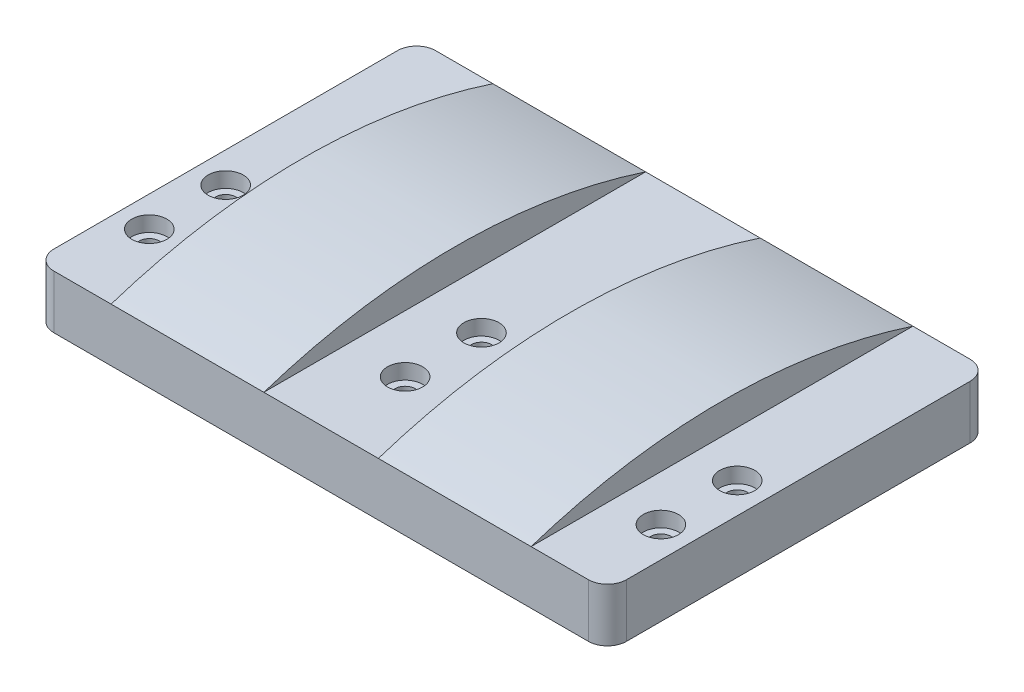
ISO-10303-21;
HEADER;
FILE_DESCRIPTION(('STEP AP214'),'2;1');
FILE_NAME('part.step','',(''),(''),'','','');
FILE_SCHEMA(('AUTOMOTIVE_DESIGN { 1 0 10303 214 1 1 1 1 }'));
ENDSEC;
DATA;
#1=APPLICATION_CONTEXT('core data for automotive mechanical design processes');
#2=APPLICATION_PROTOCOL_DEFINITION('international standard','automotive_design',2000,#1);
#3=PRODUCT_CONTEXT('',#1,'mechanical');
#4=PRODUCT('Part','Part','',(#3));
#5=PRODUCT_RELATED_PRODUCT_CATEGORY('part','',(#4));
#6=PRODUCT_DEFINITION_FORMATION('','',#4);
#7=PRODUCT_DEFINITION_CONTEXT('part definition',#1,'design');
#8=PRODUCT_DEFINITION('design','',#6,#7);
#9=PRODUCT_DEFINITION_SHAPE('','',#8);
#10=(LENGTH_UNIT() NAMED_UNIT(*) SI_UNIT(.MILLI.,.METRE.));
#11=(NAMED_UNIT(*) PLANE_ANGLE_UNIT() SI_UNIT($,.RADIAN.));
#12=(NAMED_UNIT(*) SI_UNIT($,.STERADIAN.) SOLID_ANGLE_UNIT());
#13=UNCERTAINTY_MEASURE_WITH_UNIT(LENGTH_MEASURE(1.E-05),#10,'distance_accuracy_value','');
#14=(GEOMETRIC_REPRESENTATION_CONTEXT(3) GLOBAL_UNCERTAINTY_ASSIGNED_CONTEXT((#13)) GLOBAL_UNIT_ASSIGNED_CONTEXT((#10,
#11,#12)) REPRESENTATION_CONTEXT('',''));
#15=CARTESIAN_POINT('',(0.,0.,0.));
#16=DIRECTION('',(0.,0.,1.));
#17=DIRECTION('',(1.,0.,0.));
#18=AXIS2_PLACEMENT_3D('',#15,#16,#17);
#19=CARTESIAN_POINT('',(0.,14.,0.));
#20=DIRECTION('',(0.,-1.,0.));
#21=DIRECTION('',(0.,0.,-1.));
#22=AXIS2_PLACEMENT_3D('',#19,#20,#21);
#23=PLANE('',#22);
#24=CARTESIAN_POINT('',(75.,14.,-42.));
#25=DIRECTION('',(0.,1.,0.));
#26=DIRECTION('',(0.,0.,1.));
#27=AXIS2_PLACEMENT_3D('',#24,#25,#26);
#28=CIRCLE('',#27,4.60000000000001);
#29=CARTESIAN_POINT('',(75.,14.,-37.4));
#30=VERTEX_POINT('',#29);
#31=EDGE_CURVE('E197',#30,#30,#28,.T.);
#32=ORIENTED_EDGE('',*,*,#31,.F.);
#33=EDGE_LOOP('',(#32));
#34=FACE_BOUND('',#33,.T.);
#35=CARTESIAN_POINT('',(75.,14.,-22.));
#36=DIRECTION('',(0.,1.,0.));
#37=DIRECTION('',(0.,0.,1.));
#38=AXIS2_PLACEMENT_3D('',#35,#36,#37);
#39=CIRCLE('',#38,4.6);
#40=CARTESIAN_POINT('',(75.,14.,-17.4));
#41=VERTEX_POINT('',#40);
#42=EDGE_CURVE('E216',#41,#41,#39,.T.);
#43=ORIENTED_EDGE('',*,*,#42,.F.);
#44=EDGE_LOOP('',(#43));
#45=FACE_BOUND('',#44,.T.);
#46=DIRECTION('',(0.,0.,-1.));
#47=VECTOR('',#46,1.);
#48=CARTESIAN_POINT('',(60.,14.,0.));
#49=LINE('',#48,#47);
#50=CARTESIAN_POINT('',(60.,14.,0.));
#51=VERTEX_POINT('',#50);
#52=CARTESIAN_POINT('',(60.,14.,-100.));
#53=VERTEX_POINT('',#52);
#54=EDGE_CURVE('E342',#51,#53,#49,.T.);
#55=ORIENTED_EDGE('',*,*,#54,.F.);
#56=DIRECTION('',(1.,0.,0.));
#57=VECTOR('',#56,1.);
#58=CARTESIAN_POINT('',(0.,14.,0.));
#59=LINE('',#58,#57);
#60=CARTESIAN_POINT('',(90.,14.,0.));
#61=VERTEX_POINT('',#60);
#62=EDGE_CURVE('E252',#51,#61,#59,.T.);
#63=ORIENTED_EDGE('',*,*,#62,.T.);
#64=DIRECTION('',(0.,0.,-1.));
#65=VECTOR('',#64,1.);
#66=CARTESIAN_POINT('',(90.,14.,0.));
#67=LINE('',#66,#65);
#68=CARTESIAN_POINT('',(90.,14.,-100.));
#69=VERTEX_POINT('',#68);
#70=EDGE_CURVE('E169',#61,#69,#67,.T.);
#71=ORIENTED_EDGE('',*,*,#70,.T.);
#72=DIRECTION('',(-1.,0.,0.));
#73=VECTOR('',#72,1.);
#74=CARTESIAN_POINT('',(0.,14.,-100.));
#75=LINE('',#74,#73);
#76=EDGE_CURVE('E144',#69,#53,#75,.T.);
#77=ORIENTED_EDGE('',*,*,#76,.T.);
#78=EDGE_LOOP('',(#55,#63,#71,#77));
#79=FACE_BOUND('',#78,.T.);
#80=ADVANCED_FACE('F42',(#34,#45,#79),#23,.F.);
#81=CARTESIAN_POINT('',(8.,14.,-42.));
#82=DIRECTION('',(0.,1.,0.));
#83=DIRECTION('',(0.,0.,1.));
#84=AXIS2_PLACEMENT_3D('',#81,#82,#83);
#85=CIRCLE('',#84,4.6);
#86=CARTESIAN_POINT('',(8.,14.,-37.4));
#87=VERTEX_POINT('',#86);
#88=EDGE_CURVE('E200',#87,#87,#85,.T.);
#89=ORIENTED_EDGE('',*,*,#88,.F.);
#90=EDGE_LOOP('',(#89));
#91=FACE_BOUND('',#90,.T.);
#92=CARTESIAN_POINT('',(8.,14.,-22.));
#93=DIRECTION('',(0.,1.,0.));
#94=DIRECTION('',(0.,0.,1.));
#95=AXIS2_PLACEMENT_3D('',#92,#93,#94);
#96=CIRCLE('',#95,4.6);
#97=CARTESIAN_POINT('',(8.,14.,-17.4));
#98=VERTEX_POINT('',#97);
#99=EDGE_CURVE('E210',#98,#98,#96,.T.);
#100=ORIENTED_EDGE('',*,*,#99,.F.);
#101=EDGE_LOOP('',(#100));
#102=FACE_BOUND('',#101,.T.);
#103=CARTESIAN_POINT('',(20.,14.,-100.));
#104=VERTEX_POINT('',#103);
#105=CARTESIAN_POINT('',(5.,14.,-100.));
#106=VERTEX_POINT('',#105);
#107=EDGE_CURVE('E132',#104,#106,#75,.T.);
#108=ORIENTED_EDGE('',*,*,#107,.T.);
#109=CARTESIAN_POINT('',(5.,14.,-95.));
#110=DIRECTION('',(0.,-1.,0.));
#111=DIRECTION('',(0.,0.,-1.));
#112=AXIS2_PLACEMENT_3D('',#109,#110,#111);
#113=CIRCLE('',#112,5.);
#114=CARTESIAN_POINT('',(0.,14.,-95.));
#115=VERTEX_POINT('',#114);
#116=EDGE_CURVE('E305',#106,#115,#113,.F.);
#117=ORIENTED_EDGE('',*,*,#116,.T.);
#118=DIRECTION('',(0.,0.,1.));
#119=VECTOR('',#118,1.);
#120=CARTESIAN_POINT('',(0.,14.,0.));
#121=LINE('',#120,#119);
#122=CARTESIAN_POINT('',(0.,14.,-5.));
#123=VERTEX_POINT('',#122);
#124=EDGE_CURVE('E247',#115,#123,#121,.T.);
#125=ORIENTED_EDGE('',*,*,#124,.T.);
#126=CARTESIAN_POINT('',(5.,14.,-5.));
#127=DIRECTION('',(0.,-1.,0.));
#128=DIRECTION('',(0.,0.,-1.));
#129=AXIS2_PLACEMENT_3D('',#126,#127,#128);
#130=CIRCLE('',#129,5.);
#131=CARTESIAN_POINT('',(5.,14.,0.));
#132=VERTEX_POINT('',#131);
#133=EDGE_CURVE('E57',#123,#132,#130,.F.);
#134=ORIENTED_EDGE('',*,*,#133,.T.);
#135=CARTESIAN_POINT('',(20.,14.,0.));
#136=VERTEX_POINT('',#135);
#137=EDGE_CURVE('E152',#132,#136,#59,.T.);
#138=ORIENTED_EDGE('',*,*,#137,.T.);
#139=DIRECTION('',(0.,0.,-1.));
#140=VECTOR('',#139,1.);
#141=CARTESIAN_POINT('',(20.,14.,0.));
#142=LINE('',#141,#140);
#143=EDGE_CURVE('E149',#136,#104,#142,.T.);
#144=ORIENTED_EDGE('',*,*,#143,.T.);
#145=EDGE_LOOP('',(#108,#117,#125,#134,#138,#144));
#146=FACE_BOUND('',#145,.T.);
#147=ADVANCED_FACE('F151',(#91,#102,#146),#23,.F.);
#148=CARTESIAN_POINT('',(8.,0.,-42.));
#149=DIRECTION('',(0.,1.,0.));
#150=DIRECTION('',(0.,0.,1.));
#151=AXIS2_PLACEMENT_3D('',#148,#149,#150);
#152=CYLINDRICAL_SURFACE('',#151,2.65);
#153=CARTESIAN_POINT('',(8.,0.,-42.));
#154=DIRECTION('',(0.,1.,0.));
#155=DIRECTION('',(0.,0.,1.));
#156=AXIS2_PLACEMENT_3D('',#153,#154,#155);
#157=CIRCLE('',#156,2.65);
#158=CARTESIAN_POINT('',(8.,0.,-39.35));
#159=VERTEX_POINT('',#158);
#160=EDGE_CURVE('E230',#159,#159,#157,.T.);
#161=ORIENTED_EDGE('',*,*,#160,.F.);
#162=EDGE_LOOP('',(#161));
#163=FACE_BOUND('',#162,.T.);
#164=CARTESIAN_POINT('',(8.,10.,-42.));
#165=DIRECTION('',(0.,1.,0.));
#166=DIRECTION('',(0.,0.,1.));
#167=AXIS2_PLACEMENT_3D('',#164,#165,#166);
#168=CIRCLE('',#167,2.65);
#169=CARTESIAN_POINT('',(8.,10.,-39.35));
#170=VERTEX_POINT('',#169);
#171=EDGE_CURVE('E243',#170,#170,#168,.F.);
#172=ORIENTED_EDGE('',*,*,#171,.F.);
#173=EDGE_LOOP('',(#172));
#174=FACE_BOUND('',#173,.T.);
#175=ADVANCED_FACE('F361',(#163,#174),#152,.F.);
#176=CARTESIAN_POINT('',(142.,0.,-42.));
#177=DIRECTION('',(0.,1.,0.));
#178=DIRECTION('',(0.,0.,1.));
#179=AXIS2_PLACEMENT_3D('',#176,#177,#178);
#180=CYLINDRICAL_SURFACE('',#179,2.65000000000002);
#181=CARTESIAN_POINT('',(142.,0.,-42.));
#182=DIRECTION('',(0.,1.,0.));
#183=DIRECTION('',(0.,0.,1.));
#184=AXIS2_PLACEMENT_3D('',#181,#182,#183);
#185=CIRCLE('',#184,2.65000000000002);
#186=CARTESIAN_POINT('',(142.,0.,-39.35));
#187=VERTEX_POINT('',#186);
#188=EDGE_CURVE('E227',#187,#187,#185,.T.);
#189=ORIENTED_EDGE('',*,*,#188,.F.);
#190=EDGE_LOOP('',(#189));
#191=FACE_BOUND('',#190,.T.);
#192=CARTESIAN_POINT('',(142.,10.,-42.));
#193=DIRECTION('',(0.,1.,0.));
#194=DIRECTION('',(0.,0.,1.));
#195=AXIS2_PLACEMENT_3D('',#192,#193,#194);
#196=CIRCLE('',#195,2.65000000000002);
#197=CARTESIAN_POINT('',(142.,10.,-39.35));
#198=VERTEX_POINT('',#197);
#199=EDGE_CURVE('E274',#198,#198,#196,.F.);
#200=ORIENTED_EDGE('',*,*,#199,.F.);
#201=EDGE_LOOP('',(#200));
#202=FACE_BOUND('',#201,.T.);
#203=ADVANCED_FACE('F433',(#191,#202),#180,.F.);
#204=CARTESIAN_POINT('',(75.,0.,-42.));
#205=DIRECTION('',(0.,1.,0.));
#206=DIRECTION('',(0.,0.,1.));
#207=AXIS2_PLACEMENT_3D('',#204,#205,#206);
#208=CYLINDRICAL_SURFACE('',#207,2.65);
#209=CARTESIAN_POINT('',(75.,0.,-42.));
#210=DIRECTION('',(0.,1.,0.));
#211=DIRECTION('',(0.,0.,1.));
#212=AXIS2_PLACEMENT_3D('',#209,#210,#211);
#213=CIRCLE('',#212,2.65);
#214=CARTESIAN_POINT('',(75.,0.,-39.35));
#215=VERTEX_POINT('',#214);
#216=EDGE_CURVE('E231',#215,#215,#213,.T.);
#217=ORIENTED_EDGE('',*,*,#216,.F.);
#218=EDGE_LOOP('',(#217));
#219=FACE_BOUND('',#218,.T.);
#220=CARTESIAN_POINT('',(75.,10.,-42.));
#221=DIRECTION('',(0.,1.,0.));
#222=DIRECTION('',(0.,0.,1.));
#223=AXIS2_PLACEMENT_3D('',#220,#221,#222);
#224=CIRCLE('',#223,2.65);
#225=CARTESIAN_POINT('',(75.,10.,-39.35));
#226=VERTEX_POINT('',#225);
#227=EDGE_CURVE('E271',#226,#226,#224,.F.);
#228=ORIENTED_EDGE('',*,*,#227,.F.);
#229=EDGE_LOOP('',(#228));
#230=FACE_BOUND('',#229,.T.);
#231=ADVANCED_FACE('F436',(#219,#230),#208,.F.);
#232=CARTESIAN_POINT('',(142.,0.,-22.));
#233=DIRECTION('',(0.,1.,0.));
#234=DIRECTION('',(0.,0.,1.));
#235=AXIS2_PLACEMENT_3D('',#232,#233,#234);
#236=CYLINDRICAL_SURFACE('',#235,2.65000000000001);
#237=CARTESIAN_POINT('',(142.,0.,-22.));
#238=DIRECTION('',(0.,1.,0.));
#239=DIRECTION('',(0.,0.,-1.));
#240=AXIS2_PLACEMENT_3D('',#237,#238,#239);
#241=CIRCLE('',#240,2.65000000000001);
#242=CARTESIAN_POINT('',(142.,0.,-24.65));
#243=VERTEX_POINT('',#242);
#244=EDGE_CURVE('E234',#243,#243,#241,.T.);
#245=ORIENTED_EDGE('',*,*,#244,.F.);
#246=EDGE_LOOP('',(#245));
#247=FACE_BOUND('',#246,.T.);
#248=CARTESIAN_POINT('',(142.,10.,-22.));
#249=DIRECTION('',(0.,1.,0.));
#250=DIRECTION('',(0.,0.,1.));
#251=AXIS2_PLACEMENT_3D('',#248,#249,#250);
#252=CIRCLE('',#251,2.65000000000001);
#253=CARTESIAN_POINT('',(142.,10.,-19.35));
#254=VERTEX_POINT('',#253);
#255=EDGE_CURVE('E268',#254,#254,#252,.F.);
#256=ORIENTED_EDGE('',*,*,#255,.F.);
#257=EDGE_LOOP('',(#256));
#258=FACE_BOUND('',#257,.T.);
#259=ADVANCED_FACE('F440',(#247,#258),#236,.F.);
#260=CARTESIAN_POINT('',(75.,0.,-22.));
#261=DIRECTION('',(0.,1.,0.));
#262=DIRECTION('',(0.,0.,1.));
#263=AXIS2_PLACEMENT_3D('',#260,#261,#262);
#264=CYLINDRICAL_SURFACE('',#263,2.65);
#265=CARTESIAN_POINT('',(75.,0.,-22.));
#266=DIRECTION('',(0.,1.,0.));
#267=DIRECTION('',(0.,0.,-1.));
#268=AXIS2_PLACEMENT_3D('',#265,#266,#267);
#269=CIRCLE('',#268,2.65);
#270=CARTESIAN_POINT('',(75.,0.,-24.65));
#271=VERTEX_POINT('',#270);
#272=EDGE_CURVE('E237',#271,#271,#269,.T.);
#273=ORIENTED_EDGE('',*,*,#272,.F.);
#274=EDGE_LOOP('',(#273));
#275=FACE_BOUND('',#274,.T.);
#276=CARTESIAN_POINT('',(75.,10.,-22.));
#277=DIRECTION('',(0.,1.,0.));
#278=DIRECTION('',(0.,0.,1.));
#279=AXIS2_PLACEMENT_3D('',#276,#277,#278);
#280=CIRCLE('',#279,2.65);
#281=CARTESIAN_POINT('',(75.,10.,-19.35));
#282=VERTEX_POINT('',#281);
#283=EDGE_CURVE('E265',#282,#282,#280,.F.);
#284=ORIENTED_EDGE('',*,*,#283,.F.);
#285=EDGE_LOOP('',(#284));
#286=FACE_BOUND('',#285,.T.);
#287=ADVANCED_FACE('F444',(#275,#286),#264,.F.);
#288=CARTESIAN_POINT('',(8.,0.,-22.));
#289=DIRECTION('',(0.,1.,0.));
#290=DIRECTION('',(0.,0.,1.));
#291=AXIS2_PLACEMENT_3D('',#288,#289,#290);
#292=CYLINDRICAL_SURFACE('',#291,2.65);
#293=CARTESIAN_POINT('',(8.,0.,-22.));
#294=DIRECTION('',(0.,1.,0.));
#295=DIRECTION('',(0.,0.,-1.));
#296=AXIS2_PLACEMENT_3D('',#293,#294,#295);
#297=CIRCLE('',#296,2.65);
#298=CARTESIAN_POINT('',(8.,0.,-24.65));
#299=VERTEX_POINT('',#298);
#300=EDGE_CURVE('E240',#299,#299,#297,.T.);
#301=ORIENTED_EDGE('',*,*,#300,.F.);
#302=EDGE_LOOP('',(#301));
#303=FACE_BOUND('',#302,.T.);
#304=CARTESIAN_POINT('',(8.,10.,-22.));
#305=DIRECTION('',(0.,1.,0.));
#306=DIRECTION('',(0.,0.,1.));
#307=AXIS2_PLACEMENT_3D('',#304,#305,#306);
#308=CIRCLE('',#307,2.65);
#309=CARTESIAN_POINT('',(8.,10.,-19.35));
#310=VERTEX_POINT('',#309);
#311=EDGE_CURVE('E224',#310,#310,#308,.F.);
#312=ORIENTED_EDGE('',*,*,#311,.F.);
#313=EDGE_LOOP('',(#312));
#314=FACE_BOUND('',#313,.T.);
#315=ADVANCED_FACE('F448',(#303,#314),#292,.F.);
#316=CARTESIAN_POINT('',(0.,14.,0.));
#317=DIRECTION('',(1.,0.,0.));
#318=DIRECTION('',(0.,0.,-1.));
#319=AXIS2_PLACEMENT_3D('',#316,#317,#318);
#320=PLANE('',#319);
#321=ORIENTED_EDGE('',*,*,#124,.F.);
#322=DIRECTION('',(0.,-1.,0.));
#323=VECTOR('',#322,1.);
#324=CARTESIAN_POINT('',(0.,14.,-95.));
#325=LINE('',#324,#323);
#326=CARTESIAN_POINT('',(0.,0.,-95.));
#327=VERTEX_POINT('',#326);
#328=EDGE_CURVE('E301',#115,#327,#325,.T.);
#329=ORIENTED_EDGE('',*,*,#328,.T.);
#330=DIRECTION('',(0.,0.,1.));
#331=VECTOR('',#330,1.);
#332=CARTESIAN_POINT('',(0.,0.,0.));
#333=LINE('',#332,#331);
#334=CARTESIAN_POINT('',(0.,0.,-5.));
#335=VERTEX_POINT('',#334);
#336=EDGE_CURVE('E246',#327,#335,#333,.T.);
#337=ORIENTED_EDGE('',*,*,#336,.T.);
#338=DIRECTION('',(0.,-1.,0.));
#339=VECTOR('',#338,1.);
#340=CARTESIAN_POINT('',(0.,14.,-5.));
#341=LINE('',#340,#339);
#342=EDGE_CURVE('E65',#335,#123,#341,.F.);
#343=ORIENTED_EDGE('',*,*,#342,.T.);
#344=EDGE_LOOP('',(#321,#329,#337,#343));
#345=FACE_BOUND('',#344,.T.);
#346=ADVANCED_FACE('F451',(#345),#320,.F.);
#347=CARTESIAN_POINT('',(0.,14.,0.));
#348=DIRECTION('',(0.,0.,-1.));
#349=DIRECTION('',(-1.,0.,0.));
#350=AXIS2_PLACEMENT_3D('',#347,#348,#349);
#351=PLANE('',#350);
#352=ORIENTED_EDGE('',*,*,#137,.F.);
#353=DIRECTION('',(0.,-1.,0.));
#354=VECTOR('',#353,1.);
#355=CARTESIAN_POINT('',(5.,14.,0.));
#356=LINE('',#355,#354);
#357=CARTESIAN_POINT('',(5.,0.,0.));
#358=VERTEX_POINT('',#357);
#359=EDGE_CURVE('E11',#132,#358,#356,.T.);
#360=ORIENTED_EDGE('',*,*,#359,.T.);
#361=DIRECTION('',(1.,0.,0.));
#362=VECTOR('',#361,1.);
#363=CARTESIAN_POINT('',(0.,0.,0.));
#364=LINE('',#363,#362);
#365=CARTESIAN_POINT('',(145.,0.,0.));
#366=VERTEX_POINT('',#365);
#367=EDGE_CURVE('E256',#358,#366,#364,.T.);
#368=ORIENTED_EDGE('',*,*,#367,.T.);
#369=DIRECTION('',(0.,-1.,0.));
#370=VECTOR('',#369,1.);
#371=CARTESIAN_POINT('',(145.,14.,0.));
#372=LINE('',#371,#370);
#373=CARTESIAN_POINT('',(145.,14.,0.));
#374=VERTEX_POINT('',#373);
#375=EDGE_CURVE('E50',#366,#374,#372,.F.);
#376=ORIENTED_EDGE('',*,*,#375,.T.);
#377=CARTESIAN_POINT('',(130.,14.,0.));
#378=VERTEX_POINT('',#377);
#379=EDGE_CURVE('E249',#378,#374,#59,.T.);
#380=ORIENTED_EDGE('',*,*,#379,.F.);
#381=DIRECTION('',(-1.,0.,0.));
#382=VECTOR('',#381,1.);
#383=CARTESIAN_POINT('',(130.,14.,0.));
#384=LINE('',#383,#382);
#385=EDGE_CURVE('E181',#378,#61,#384,.T.);
#386=ORIENTED_EDGE('',*,*,#385,.T.);
#387=ORIENTED_EDGE('',*,*,#62,.F.);
#388=DIRECTION('',(1.,0.,0.));
#389=VECTOR('',#388,1.);
#390=CARTESIAN_POINT('',(20.,14.,0.));
#391=LINE('',#390,#389);
#392=EDGE_CURVE('E167',#136,#51,#391,.T.);
#393=ORIENTED_EDGE('',*,*,#392,.F.);
#394=EDGE_LOOP('',(#352,#360,#368,#376,#380,#386,#387,#393));
#395=FACE_BOUND('',#394,.T.);
#396=ADVANCED_FACE('F310',(#395),#351,.F.);
#397=CARTESIAN_POINT('',(150.,14.,0.));
#398=DIRECTION('',(-1.,0.,0.));
#399=DIRECTION('',(0.,0.,1.));
#400=AXIS2_PLACEMENT_3D('',#397,#398,#399);
#401=PLANE('',#400);
#402=DIRECTION('',(0.,0.,-1.));
#403=VECTOR('',#402,1.);
#404=CARTESIAN_POINT('',(150.,0.,0.));
#405=LINE('',#404,#403);
#406=CARTESIAN_POINT('',(150.,0.,-5.));
#407=VERTEX_POINT('',#406);
#408=CARTESIAN_POINT('',(150.,0.,-95.));
#409=VERTEX_POINT('',#408);
#410=EDGE_CURVE('E259',#407,#409,#405,.T.);
#411=ORIENTED_EDGE('',*,*,#410,.T.);
#412=DIRECTION('',(0.,-1.,0.));
#413=VECTOR('',#412,1.);
#414=CARTESIAN_POINT('',(150.,14.,-95.));
#415=LINE('',#414,#413);
#416=CARTESIAN_POINT('',(150.,14.,-95.));
#417=VERTEX_POINT('',#416);
#418=EDGE_CURVE('E294',#409,#417,#415,.F.);
#419=ORIENTED_EDGE('',*,*,#418,.T.);
#420=DIRECTION('',(0.,0.,-1.));
#421=VECTOR('',#420,1.);
#422=CARTESIAN_POINT('',(150.,14.,0.));
#423=LINE('',#422,#421);
#424=CARTESIAN_POINT('',(150.,14.,-5.));
#425=VERTEX_POINT('',#424);
#426=EDGE_CURVE('E145',#425,#417,#423,.T.);
#427=ORIENTED_EDGE('',*,*,#426,.F.);
#428=DIRECTION('',(0.,-1.,0.));
#429=VECTOR('',#428,1.);
#430=CARTESIAN_POINT('',(150.,14.,-5.));
#431=LINE('',#430,#429);
#432=EDGE_CURVE('E291',#425,#407,#431,.T.);
#433=ORIENTED_EDGE('',*,*,#432,.T.);
#434=EDGE_LOOP('',(#411,#419,#427,#433));
#435=FACE_BOUND('',#434,.T.);
#436=ADVANCED_FACE('F321',(#435),#401,.F.);
#437=CARTESIAN_POINT('',(0.,14.,-100.));
#438=DIRECTION('',(0.,0.,1.));
#439=DIRECTION('',(1.,0.,0.));
#440=AXIS2_PLACEMENT_3D('',#437,#438,#439);
#441=PLANE('',#440);
#442=CARTESIAN_POINT('',(145.,14.,-100.));
#443=VERTEX_POINT('',#442);
#444=CARTESIAN_POINT('',(130.,14.,-100.));
#445=VERTEX_POINT('',#444);
#446=EDGE_CURVE('E147',#443,#445,#75,.T.);
#447=ORIENTED_EDGE('',*,*,#446,.F.);
#448=DIRECTION('',(0.,-1.,0.));
#449=VECTOR('',#448,1.);
#450=CARTESIAN_POINT('',(145.,14.,-100.));
#451=LINE('',#450,#449);
#452=CARTESIAN_POINT('',(145.,0.,-100.));
#453=VERTEX_POINT('',#452);
#454=EDGE_CURVE('E280',#443,#453,#451,.T.);
#455=ORIENTED_EDGE('',*,*,#454,.T.);
#456=DIRECTION('',(-1.,0.,0.));
#457=VECTOR('',#456,1.);
#458=CARTESIAN_POINT('',(0.,0.,-100.));
#459=LINE('',#458,#457);
#460=CARTESIAN_POINT('',(5.,0.,-100.));
#461=VERTEX_POINT('',#460);
#462=EDGE_CURVE('E250',#453,#461,#459,.T.);
#463=ORIENTED_EDGE('',*,*,#462,.T.);
#464=DIRECTION('',(0.,-1.,0.));
#465=VECTOR('',#464,1.);
#466=CARTESIAN_POINT('',(5.,14.,-100.));
#467=LINE('',#466,#465);
#468=EDGE_CURVE('E142',#461,#106,#467,.F.);
#469=ORIENTED_EDGE('',*,*,#468,.T.);
#470=ORIENTED_EDGE('',*,*,#107,.F.);
#471=DIRECTION('',(1.,0.,0.));
#472=VECTOR('',#471,1.);
#473=CARTESIAN_POINT('',(20.,14.,-100.));
#474=LINE('',#473,#472);
#475=EDGE_CURVE('E138',#104,#53,#474,.T.);
#476=ORIENTED_EDGE('',*,*,#475,.T.);
#477=ORIENTED_EDGE('',*,*,#76,.F.);
#478=DIRECTION('',(-1.,0.,0.));
#479=VECTOR('',#478,1.);
#480=CARTESIAN_POINT('',(130.,14.,-100.));
#481=LINE('',#480,#479);
#482=EDGE_CURVE('E187',#445,#69,#481,.T.);
#483=ORIENTED_EDGE('',*,*,#482,.F.);
#484=EDGE_LOOP('',(#447,#455,#463,#469,#470,#476,#477,#483));
#485=FACE_BOUND('',#484,.T.);
#486=ADVANCED_FACE('F135',(#485),#441,.F.);
#487=CARTESIAN_POINT('',(142.,14.,-42.));
#488=DIRECTION('',(0.,1.,0.));
#489=DIRECTION('',(0.,0.,1.));
#490=AXIS2_PLACEMENT_3D('',#487,#488,#489);
#491=CIRCLE('',#490,4.59999999999999);
#492=CARTESIAN_POINT('',(142.,14.,-37.4000000000001));
#493=VERTEX_POINT('',#492);
#494=EDGE_CURVE('E204',#493,#493,#491,.T.);
#495=ORIENTED_EDGE('',*,*,#494,.F.);
#496=EDGE_LOOP('',(#495));
#497=FACE_BOUND('',#496,.T.);
#498=CARTESIAN_POINT('',(142.,14.,-22.));
#499=DIRECTION('',(0.,1.,0.));
#500=DIRECTION('',(0.,0.,1.));
#501=AXIS2_PLACEMENT_3D('',#498,#499,#500);
#502=CIRCLE('',#501,4.59999999999999);
#503=CARTESIAN_POINT('',(142.,14.,-17.4));
#504=VERTEX_POINT('',#503);
#505=EDGE_CURVE('E191',#504,#504,#502,.T.);
#506=ORIENTED_EDGE('',*,*,#505,.F.);
#507=EDGE_LOOP('',(#506));
#508=FACE_BOUND('',#507,.T.);
#509=ORIENTED_EDGE('',*,*,#426,.T.);
#510=CARTESIAN_POINT('',(145.,14.,-95.));
#511=DIRECTION('',(0.,-1.,0.));
#512=DIRECTION('',(0.,0.,-1.));
#513=AXIS2_PLACEMENT_3D('',#510,#511,#512);
#514=CIRCLE('',#513,5.);
#515=EDGE_CURVE('E298',#417,#443,#514,.F.);
#516=ORIENTED_EDGE('',*,*,#515,.T.);
#517=ORIENTED_EDGE('',*,*,#446,.T.);
#518=DIRECTION('',(0.,0.,-1.));
#519=VECTOR('',#518,1.);
#520=CARTESIAN_POINT('',(130.,14.,0.));
#521=LINE('',#520,#519);
#522=EDGE_CURVE('E174',#378,#445,#521,.T.);
#523=ORIENTED_EDGE('',*,*,#522,.F.);
#524=ORIENTED_EDGE('',*,*,#379,.T.);
#525=CARTESIAN_POINT('',(145.,14.,-5.));
#526=DIRECTION('',(0.,-1.,0.));
#527=DIRECTION('',(0.,0.,-1.));
#528=AXIS2_PLACEMENT_3D('',#525,#526,#527);
#529=CIRCLE('',#528,5.);
#530=EDGE_CURVE('E296',#374,#425,#529,.F.);
#531=ORIENTED_EDGE('',*,*,#530,.T.);
#532=EDGE_LOOP('',(#509,#516,#517,#523,#524,#531));
#533=FACE_BOUND('',#532,.T.);
#534=ADVANCED_FACE('F316',(#497,#508,#533),#23,.F.);
#535=CARTESIAN_POINT('',(0.,0.,0.));
#536=DIRECTION('',(0.,-1.,0.));
#537=DIRECTION('',(0.,0.,-1.));
#538=AXIS2_PLACEMENT_3D('',#535,#536,#537);
#539=PLANE('',#538);
#540=ORIENTED_EDGE('',*,*,#300,.T.);
#541=EDGE_LOOP('',(#540));
#542=FACE_BOUND('',#541,.T.);
#543=ORIENTED_EDGE('',*,*,#272,.T.);
#544=EDGE_LOOP('',(#543));
#545=FACE_BOUND('',#544,.T.);
#546=ORIENTED_EDGE('',*,*,#244,.T.);
#547=EDGE_LOOP('',(#546));
#548=FACE_BOUND('',#547,.T.);
#549=ORIENTED_EDGE('',*,*,#216,.T.);
#550=EDGE_LOOP('',(#549));
#551=FACE_BOUND('',#550,.T.);
#552=ORIENTED_EDGE('',*,*,#188,.T.);
#553=EDGE_LOOP('',(#552));
#554=FACE_BOUND('',#553,.T.);
#555=ORIENTED_EDGE('',*,*,#160,.T.);
#556=EDGE_LOOP('',(#555));
#557=FACE_BOUND('',#556,.T.);
#558=ORIENTED_EDGE('',*,*,#462,.F.);
#559=CARTESIAN_POINT('',(145.,0.,-95.));
#560=DIRECTION('',(0.,-1.,0.));
#561=DIRECTION('',(0.,0.,-1.));
#562=AXIS2_PLACEMENT_3D('',#559,#560,#561);
#563=CIRCLE('',#562,5.);
#564=EDGE_CURVE('E289',#453,#409,#563,.T.);
#565=ORIENTED_EDGE('',*,*,#564,.T.);
#566=ORIENTED_EDGE('',*,*,#410,.F.);
#567=CARTESIAN_POINT('',(145.,0.,-5.));
#568=DIRECTION('',(0.,-1.,0.));
#569=DIRECTION('',(0.,0.,-1.));
#570=AXIS2_PLACEMENT_3D('',#567,#568,#569);
#571=CIRCLE('',#570,5.);
#572=EDGE_CURVE('E283',#407,#366,#571,.T.);
#573=ORIENTED_EDGE('',*,*,#572,.T.);
#574=ORIENTED_EDGE('',*,*,#367,.F.);
#575=CARTESIAN_POINT('',(5.,0.,-5.));
#576=DIRECTION('',(0.,-1.,0.));
#577=DIRECTION('',(0.,0.,-1.));
#578=AXIS2_PLACEMENT_3D('',#575,#576,#577);
#579=CIRCLE('',#578,5.);
#580=EDGE_CURVE('E285',#358,#335,#579,.T.);
#581=ORIENTED_EDGE('',*,*,#580,.T.);
#582=ORIENTED_EDGE('',*,*,#336,.F.);
#583=CARTESIAN_POINT('',(5.,0.,-95.));
#584=DIRECTION('',(0.,-1.,0.));
#585=DIRECTION('',(0.,0.,-1.));
#586=AXIS2_PLACEMENT_3D('',#583,#584,#585);
#587=CIRCLE('',#586,5.);
#588=EDGE_CURVE('E287',#327,#461,#587,.T.);
#589=ORIENTED_EDGE('',*,*,#588,.T.);
#590=EDGE_LOOP('',(#558,#565,#566,#573,#574,#581,#582,#589));
#591=FACE_BOUND('',#590,.T.);
#592=ADVANCED_FACE('F325',(#542,#545,#548,#551,#554,#557,#591),#539,.T.);
#593=CARTESIAN_POINT('',(8.,10.,-22.));
#594=DIRECTION('',(0.,1.,0.));
#595=DIRECTION('',(0.,0.,1.));
#596=AXIS2_PLACEMENT_3D('',#593,#594,#595);
#597=PLANE('',#596);
#598=CARTESIAN_POINT('',(8.,10.,-22.));
#599=DIRECTION('',(0.,1.,0.));
#600=DIRECTION('',(0.,0.,1.));
#601=AXIS2_PLACEMENT_3D('',#598,#599,#600);
#602=CIRCLE('',#601,4.6);
#603=CARTESIAN_POINT('',(8.,10.,-17.4));
#604=VERTEX_POINT('',#603);
#605=EDGE_CURVE('E213',#604,#604,#602,.T.);
#606=ORIENTED_EDGE('',*,*,#605,.T.);
#607=EDGE_LOOP('',(#606));
#608=FACE_BOUND('',#607,.T.);
#609=ORIENTED_EDGE('',*,*,#311,.T.);
#610=EDGE_LOOP('',(#609));
#611=FACE_BOUND('',#610,.T.);
#612=ADVANCED_FACE('F373',(#608,#611),#597,.T.);
#613=CARTESIAN_POINT('',(8.,10.,-22.));
#614=DIRECTION('',(0.,1.,0.));
#615=DIRECTION('',(0.,0.,1.));
#616=AXIS2_PLACEMENT_3D('',#613,#614,#615);
#617=CYLINDRICAL_SURFACE('',#616,4.6);
#618=ORIENTED_EDGE('',*,*,#605,.F.);
#619=EDGE_LOOP('',(#618));
#620=FACE_BOUND('',#619,.T.);
#621=ORIENTED_EDGE('',*,*,#99,.T.);
#622=EDGE_LOOP('',(#621));
#623=FACE_BOUND('',#622,.T.);
#624=ADVANCED_FACE('F412',(#620,#623),#617,.F.);
#625=CARTESIAN_POINT('',(75.,10.,-22.));
#626=DIRECTION('',(0.,1.,0.));
#627=DIRECTION('',(0.,0.,1.));
#628=AXIS2_PLACEMENT_3D('',#625,#626,#627);
#629=PLANE('',#628);
#630=CARTESIAN_POINT('',(75.,10.,-22.));
#631=DIRECTION('',(0.,1.,0.));
#632=DIRECTION('',(0.,0.,1.));
#633=AXIS2_PLACEMENT_3D('',#630,#631,#632);
#634=CIRCLE('',#633,4.6);
#635=CARTESIAN_POINT('',(75.,10.,-17.4));
#636=VERTEX_POINT('',#635);
#637=EDGE_CURVE('E194',#636,#636,#634,.T.);
#638=ORIENTED_EDGE('',*,*,#637,.T.);
#639=EDGE_LOOP('',(#638));
#640=FACE_BOUND('',#639,.T.);
#641=ORIENTED_EDGE('',*,*,#283,.T.);
#642=EDGE_LOOP('',(#641));
#643=FACE_BOUND('',#642,.T.);
#644=ADVANCED_FACE('F415',(#640,#643),#629,.T.);
#645=CARTESIAN_POINT('',(75.,10.,-22.));
#646=DIRECTION('',(0.,1.,0.));
#647=DIRECTION('',(0.,0.,1.));
#648=AXIS2_PLACEMENT_3D('',#645,#646,#647);
#649=CYLINDRICAL_SURFACE('',#648,4.6);
#650=ORIENTED_EDGE('',*,*,#637,.F.);
#651=EDGE_LOOP('',(#650));
#652=FACE_BOUND('',#651,.T.);
#653=ORIENTED_EDGE('',*,*,#42,.T.);
#654=EDGE_LOOP('',(#653));
#655=FACE_BOUND('',#654,.T.);
#656=ADVANCED_FACE('F393',(#652,#655),#649,.F.);
#657=CARTESIAN_POINT('',(142.,10.,-22.));
#658=DIRECTION('',(0.,1.,0.));
#659=DIRECTION('',(0.,0.,1.));
#660=AXIS2_PLACEMENT_3D('',#657,#658,#659);
#661=PLANE('',#660);
#662=CARTESIAN_POINT('',(142.,10.,-22.));
#663=DIRECTION('',(0.,1.,0.));
#664=DIRECTION('',(0.,0.,1.));
#665=AXIS2_PLACEMENT_3D('',#662,#663,#664);
#666=CIRCLE('',#665,4.59999999999999);
#667=CARTESIAN_POINT('',(142.,10.,-17.4));
#668=VERTEX_POINT('',#667);
#669=EDGE_CURVE('E190',#668,#668,#666,.T.);
#670=ORIENTED_EDGE('',*,*,#669,.T.);
#671=EDGE_LOOP('',(#670));
#672=FACE_BOUND('',#671,.T.);
#673=ORIENTED_EDGE('',*,*,#255,.T.);
#674=EDGE_LOOP('',(#673));
#675=FACE_BOUND('',#674,.T.);
#676=ADVANCED_FACE('F383',(#672,#675),#661,.T.);
#677=CARTESIAN_POINT('',(142.,10.,-22.));
#678=DIRECTION('',(0.,1.,0.));
#679=DIRECTION('',(0.,0.,1.));
#680=AXIS2_PLACEMENT_3D('',#677,#678,#679);
#681=CYLINDRICAL_SURFACE('',#680,4.59999999999999);
#682=ORIENTED_EDGE('',*,*,#669,.F.);
#683=EDGE_LOOP('',(#682));
#684=FACE_BOUND('',#683,.T.);
#685=ORIENTED_EDGE('',*,*,#505,.T.);
#686=EDGE_LOOP('',(#685));
#687=FACE_BOUND('',#686,.T.);
#688=ADVANCED_FACE('F380',(#684,#687),#681,.F.);
#689=CARTESIAN_POINT('',(75.,10.,-42.));
#690=DIRECTION('',(0.,1.,0.));
#691=DIRECTION('',(0.,0.,1.));
#692=AXIS2_PLACEMENT_3D('',#689,#690,#691);
#693=PLANE('',#692);
#694=CARTESIAN_POINT('',(75.,10.,-42.));
#695=DIRECTION('',(0.,1.,0.));
#696=DIRECTION('',(0.,0.,1.));
#697=AXIS2_PLACEMENT_3D('',#694,#695,#696);
#698=CIRCLE('',#697,4.60000000000001);
#699=CARTESIAN_POINT('',(75.,10.,-37.4));
#700=VERTEX_POINT('',#699);
#701=EDGE_CURVE('E201',#700,#700,#698,.T.);
#702=ORIENTED_EDGE('',*,*,#701,.T.);
#703=EDGE_LOOP('',(#702));
#704=FACE_BOUND('',#703,.T.);
#705=ORIENTED_EDGE('',*,*,#227,.T.);
#706=EDGE_LOOP('',(#705));
#707=FACE_BOUND('',#706,.T.);
#708=ADVANCED_FACE('F382',(#704,#707),#693,.T.);
#709=CARTESIAN_POINT('',(75.,10.,-42.));
#710=DIRECTION('',(0.,1.,0.));
#711=DIRECTION('',(0.,0.,1.));
#712=AXIS2_PLACEMENT_3D('',#709,#710,#711);
#713=CYLINDRICAL_SURFACE('',#712,4.60000000000001);
#714=ORIENTED_EDGE('',*,*,#701,.F.);
#715=EDGE_LOOP('',(#714));
#716=FACE_BOUND('',#715,.T.);
#717=ORIENTED_EDGE('',*,*,#31,.T.);
#718=EDGE_LOOP('',(#717));
#719=FACE_BOUND('',#718,.T.);
#720=ADVANCED_FACE('F390',(#716,#719),#713,.F.);
#721=CARTESIAN_POINT('',(142.,10.,-42.));
#722=DIRECTION('',(0.,1.,0.));
#723=DIRECTION('',(0.,0.,1.));
#724=AXIS2_PLACEMENT_3D('',#721,#722,#723);
#725=PLANE('',#724);
#726=CARTESIAN_POINT('',(142.,10.,-42.));
#727=DIRECTION('',(0.,1.,0.));
#728=DIRECTION('',(0.,0.,1.));
#729=AXIS2_PLACEMENT_3D('',#726,#727,#728);
#730=CIRCLE('',#729,4.59999999999999);
#731=CARTESIAN_POINT('',(142.,10.,-37.4000000000001));
#732=VERTEX_POINT('',#731);
#733=EDGE_CURVE('E207',#732,#732,#730,.T.);
#734=ORIENTED_EDGE('',*,*,#733,.T.);
#735=EDGE_LOOP('',(#734));
#736=FACE_BOUND('',#735,.T.);
#737=ORIENTED_EDGE('',*,*,#199,.T.);
#738=EDGE_LOOP('',(#737));
#739=FACE_BOUND('',#738,.T.);
#740=ADVANCED_FACE('F401',(#736,#739),#725,.T.);
#741=CARTESIAN_POINT('',(142.,10.,-42.));
#742=DIRECTION('',(0.,1.,0.));
#743=DIRECTION('',(0.,0.,1.));
#744=AXIS2_PLACEMENT_3D('',#741,#742,#743);
#745=CYLINDRICAL_SURFACE('',#744,4.59999999999999);
#746=ORIENTED_EDGE('',*,*,#733,.F.);
#747=EDGE_LOOP('',(#746));
#748=FACE_BOUND('',#747,.T.);
#749=ORIENTED_EDGE('',*,*,#494,.T.);
#750=EDGE_LOOP('',(#749));
#751=FACE_BOUND('',#750,.T.);
#752=ADVANCED_FACE('F404',(#748,#751),#745,.F.);
#753=CARTESIAN_POINT('',(8.,10.,-42.));
#754=DIRECTION('',(0.,1.,0.));
#755=DIRECTION('',(0.,0.,1.));
#756=AXIS2_PLACEMENT_3D('',#753,#754,#755);
#757=PLANE('',#756);
#758=CARTESIAN_POINT('',(8.,10.,-42.));
#759=DIRECTION('',(0.,1.,0.));
#760=DIRECTION('',(0.,0.,1.));
#761=AXIS2_PLACEMENT_3D('',#758,#759,#760);
#762=CIRCLE('',#761,4.6);
#763=CARTESIAN_POINT('',(8.,10.,-37.4));
#764=VERTEX_POINT('',#763);
#765=EDGE_CURVE('E221',#764,#764,#762,.T.);
#766=ORIENTED_EDGE('',*,*,#765,.T.);
#767=EDGE_LOOP('',(#766));
#768=FACE_BOUND('',#767,.T.);
#769=ORIENTED_EDGE('',*,*,#171,.T.);
#770=EDGE_LOOP('',(#769));
#771=FACE_BOUND('',#770,.T.);
#772=ADVANCED_FACE('F407',(#768,#771),#757,.T.);
#773=CARTESIAN_POINT('',(8.,10.,-42.));
#774=DIRECTION('',(0.,1.,0.));
#775=DIRECTION('',(0.,0.,1.));
#776=AXIS2_PLACEMENT_3D('',#773,#774,#775);
#777=CYLINDRICAL_SURFACE('',#776,4.6);
#778=ORIENTED_EDGE('',*,*,#765,.F.);
#779=EDGE_LOOP('',(#778));
#780=FACE_BOUND('',#779,.T.);
#781=ORIENTED_EDGE('',*,*,#88,.T.);
#782=EDGE_LOOP('',(#781));
#783=FACE_BOUND('',#782,.T.);
#784=ADVANCED_FACE('F428',(#780,#783),#777,.F.);
#785=CARTESIAN_POINT('',(130.,-138.25,-50.));
#786=DIRECTION('',(-1.,0.,0.));
#787=DIRECTION('',(0.,0.,1.));
#788=AXIS2_PLACEMENT_3D('',#785,#786,#787);
#789=CYLINDRICAL_SURFACE('',#788,160.25);
#790=CARTESIAN_POINT('',(90.,-138.25,-50.));
#791=DIRECTION('',(1.,0.,0.));
#792=DIRECTION('',(0.,0.,-1.));
#793=AXIS2_PLACEMENT_3D('',#790,#791,#792);
#794=CIRCLE('',#793,160.25);
#795=EDGE_CURVE('E178',#61,#69,#794,.F.);
#796=ORIENTED_EDGE('',*,*,#795,.F.);
#797=ORIENTED_EDGE('',*,*,#385,.F.);
#798=CARTESIAN_POINT('',(130.,-138.25,-50.));
#799=DIRECTION('',(1.,0.,0.));
#800=DIRECTION('',(0.,0.,-1.));
#801=AXIS2_PLACEMENT_3D('',#798,#799,#800);
#802=CIRCLE('',#801,160.25);
#803=EDGE_CURVE('E177',#378,#445,#802,.F.);
#804=ORIENTED_EDGE('',*,*,#803,.T.);
#805=ORIENTED_EDGE('',*,*,#482,.T.);
#806=EDGE_LOOP('',(#796,#797,#804,#805));
#807=FACE_BOUND('',#806,.T.);
#808=ADVANCED_FACE('F336',(#807),#789,.T.);
#809=CARTESIAN_POINT('',(130.,0.,0.));
#810=DIRECTION('',(1.,0.,0.));
#811=DIRECTION('',(0.,0.,-1.));
#812=AXIS2_PLACEMENT_3D('',#809,#810,#811);
#813=PLANE('',#812);
#814=ORIENTED_EDGE('',*,*,#522,.T.);
#815=ORIENTED_EDGE('',*,*,#803,.F.);
#816=EDGE_LOOP('',(#814,#815));
#817=FACE_BOUND('',#816,.T.);
#818=ADVANCED_FACE('F335',(#817),#813,.T.);
#819=CARTESIAN_POINT('',(90.,0.,0.));
#820=DIRECTION('',(1.,0.,0.));
#821=DIRECTION('',(0.,0.,-1.));
#822=AXIS2_PLACEMENT_3D('',#819,#820,#821);
#823=PLANE('',#822);
#824=ORIENTED_EDGE('',*,*,#70,.F.);
#825=ORIENTED_EDGE('',*,*,#795,.T.);
#826=EDGE_LOOP('',(#824,#825));
#827=FACE_BOUND('',#826,.T.);
#828=ADVANCED_FACE('F340',(#827),#823,.F.);
#829=CARTESIAN_POINT('',(20.,-138.25,-50.));
#830=DIRECTION('',(1.,0.,0.));
#831=DIRECTION('',(0.,0.,-1.));
#832=AXIS2_PLACEMENT_3D('',#829,#830,#831);
#833=CYLINDRICAL_SURFACE('',#832,160.25);
#834=CARTESIAN_POINT('',(60.,-138.25,-50.));
#835=DIRECTION('',(1.,0.,0.));
#836=DIRECTION('',(0.,0.,-1.));
#837=AXIS2_PLACEMENT_3D('',#834,#835,#836);
#838=CIRCLE('',#837,160.25);
#839=EDGE_CURVE('E156',#51,#53,#838,.F.);
#840=ORIENTED_EDGE('',*,*,#839,.T.);
#841=ORIENTED_EDGE('',*,*,#475,.F.);
#842=CARTESIAN_POINT('',(20.,-138.25,-50.));
#843=DIRECTION('',(1.,0.,0.));
#844=DIRECTION('',(0.,0.,-1.));
#845=AXIS2_PLACEMENT_3D('',#842,#843,#844);
#846=CIRCLE('',#845,160.25);
#847=EDGE_CURVE('E155',#136,#104,#846,.F.);
#848=ORIENTED_EDGE('',*,*,#847,.F.);
#849=ORIENTED_EDGE('',*,*,#392,.T.);
#850=EDGE_LOOP('',(#840,#841,#848,#849));
#851=FACE_BOUND('',#850,.T.);
#852=ADVANCED_FACE('F164',(#851),#833,.T.);
#853=CARTESIAN_POINT('',(20.,0.,0.));
#854=DIRECTION('',(-1.,0.,0.));
#855=DIRECTION('',(0.,0.,-1.));
#856=AXIS2_PLACEMENT_3D('',#853,#854,#855);
#857=PLANE('',#856);
#858=ORIENTED_EDGE('',*,*,#143,.F.);
#859=ORIENTED_EDGE('',*,*,#847,.T.);
#860=EDGE_LOOP('',(#858,#859));
#861=FACE_BOUND('',#860,.T.);
#862=ADVANCED_FACE('F159',(#861),#857,.T.);
#863=CARTESIAN_POINT('',(60.,0.,0.));
#864=DIRECTION('',(-1.,0.,0.));
#865=DIRECTION('',(0.,0.,-1.));
#866=AXIS2_PLACEMENT_3D('',#863,#864,#865);
#867=PLANE('',#866);
#868=ORIENTED_EDGE('',*,*,#54,.T.);
#869=ORIENTED_EDGE('',*,*,#839,.F.);
#870=EDGE_LOOP('',(#868,#869));
#871=FACE_BOUND('',#870,.T.);
#872=ADVANCED_FACE('F344',(#871),#867,.F.);
#873=CARTESIAN_POINT('',(145.,14.,-95.));
#874=DIRECTION('',(0.,-1.,0.));
#875=DIRECTION('',(0.,0.,-1.));
#876=AXIS2_PLACEMENT_3D('',#873,#874,#875);
#877=CYLINDRICAL_SURFACE('',#876,5.);
#878=ORIENTED_EDGE('',*,*,#515,.F.);
#879=ORIENTED_EDGE('',*,*,#418,.F.);
#880=ORIENTED_EDGE('',*,*,#564,.F.);
#881=ORIENTED_EDGE('',*,*,#454,.F.);
#882=EDGE_LOOP('',(#878,#879,#880,#881));
#883=FACE_BOUND('',#882,.T.);
#884=ADVANCED_FACE('F329',(#883),#877,.T.);
#885=CARTESIAN_POINT('',(5.,14.,-95.));
#886=DIRECTION('',(0.,-1.,0.));
#887=DIRECTION('',(0.,0.,-1.));
#888=AXIS2_PLACEMENT_3D('',#885,#886,#887);
#889=CYLINDRICAL_SURFACE('',#888,5.);
#890=ORIENTED_EDGE('',*,*,#116,.F.);
#891=ORIENTED_EDGE('',*,*,#468,.F.);
#892=ORIENTED_EDGE('',*,*,#588,.F.);
#893=ORIENTED_EDGE('',*,*,#328,.F.);
#894=EDGE_LOOP('',(#890,#891,#892,#893));
#895=FACE_BOUND('',#894,.T.);
#896=ADVANCED_FACE('F351',(#895),#889,.T.);
#897=CARTESIAN_POINT('',(5.,14.,-5.));
#898=DIRECTION('',(0.,-1.,0.));
#899=DIRECTION('',(0.,0.,-1.));
#900=AXIS2_PLACEMENT_3D('',#897,#898,#899);
#901=CYLINDRICAL_SURFACE('',#900,5.);
#902=ORIENTED_EDGE('',*,*,#133,.F.);
#903=ORIENTED_EDGE('',*,*,#342,.F.);
#904=ORIENTED_EDGE('',*,*,#580,.F.);
#905=ORIENTED_EDGE('',*,*,#359,.F.);
#906=EDGE_LOOP('',(#902,#903,#904,#905));
#907=FACE_BOUND('',#906,.T.);
#908=ADVANCED_FACE('F538',(#907),#901,.T.);
#909=CARTESIAN_POINT('',(145.,14.,-5.));
#910=DIRECTION('',(0.,-1.,0.));
#911=DIRECTION('',(0.,0.,-1.));
#912=AXIS2_PLACEMENT_3D('',#909,#910,#911);
#913=CYLINDRICAL_SURFACE('',#912,5.);
#914=ORIENTED_EDGE('',*,*,#530,.F.);
#915=ORIENTED_EDGE('',*,*,#375,.F.);
#916=ORIENTED_EDGE('',*,*,#572,.F.);
#917=ORIENTED_EDGE('',*,*,#432,.F.);
#918=EDGE_LOOP('',(#914,#915,#916,#917));
#919=FACE_BOUND('',#918,.T.);
#920=ADVANCED_FACE('F44',(#919),#913,.T.);
#921=CLOSED_SHELL('',(#80,#147,#175,#203,#231,#259,#287,#315,#346,#396,#436,#486,#534,#592,#612,
#624,#644,#656,#676,#688,#708,#720,#740,#752,#772,#784,#808,#818,#828,#852,#862,#872,#884,#896,
#908,#920));
#922=MANIFOLD_SOLID_BREP('B2',#921);
#923=ADVANCED_BREP_SHAPE_REPRESENTATION('',(#18,#922),#14);
#924=SHAPE_DEFINITION_REPRESENTATION(#9,#923);
ENDSEC;
END-ISO-10303-21;
